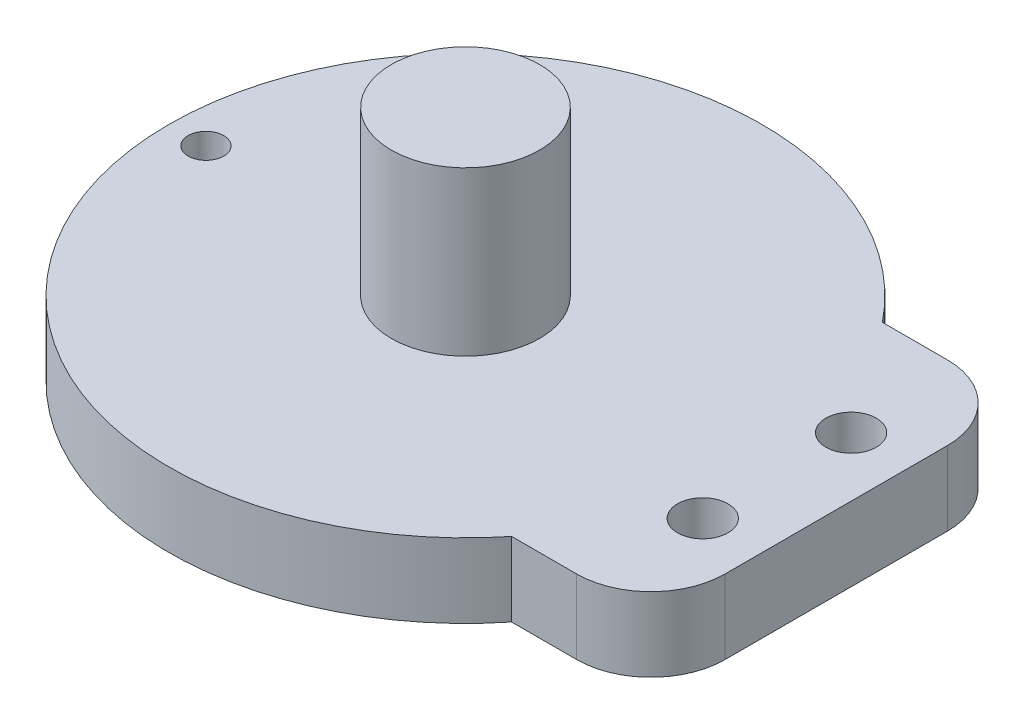
ISO-10303-21;
HEADER;
FILE_DESCRIPTION(('STEP AP214'),'2;1');
FILE_NAME('part.step','',(''),(''),'','','');
FILE_SCHEMA(('AUTOMOTIVE_DESIGN { 1 0 10303 214 1 1 1 1 }'));
ENDSEC;
DATA;
#1=APPLICATION_CONTEXT('core data for automotive mechanical design processes');
#2=APPLICATION_PROTOCOL_DEFINITION('international standard','automotive_design',2000,#1);
#3=PRODUCT_CONTEXT('',#1,'mechanical');
#4=PRODUCT('Part','Part','',(#3));
#5=PRODUCT_RELATED_PRODUCT_CATEGORY('part','',(#4));
#6=PRODUCT_DEFINITION_FORMATION('','',#4);
#7=PRODUCT_DEFINITION_CONTEXT('part definition',#1,'design');
#8=PRODUCT_DEFINITION('design','',#6,#7);
#9=PRODUCT_DEFINITION_SHAPE('','',#8);
#10=(LENGTH_UNIT() NAMED_UNIT(*) SI_UNIT(.MILLI.,.METRE.));
#11=(NAMED_UNIT(*) PLANE_ANGLE_UNIT() SI_UNIT($,.RADIAN.));
#12=(NAMED_UNIT(*) SI_UNIT($,.STERADIAN.) SOLID_ANGLE_UNIT());
#13=UNCERTAINTY_MEASURE_WITH_UNIT(LENGTH_MEASURE(1.E-05),#10,'distance_accuracy_value','');
#14=(GEOMETRIC_REPRESENTATION_CONTEXT(3) GLOBAL_UNCERTAINTY_ASSIGNED_CONTEXT((#13)) GLOBAL_UNIT_ASSIGNED_CONTEXT((#10,
#11,#12)) REPRESENTATION_CONTEXT('',''));
#15=CARTESIAN_POINT('',(0.,0.,0.));
#16=DIRECTION('',(0.,0.,1.));
#17=DIRECTION('',(1.,0.,0.));
#18=AXIS2_PLACEMENT_3D('',#15,#16,#17);
#19=CARTESIAN_POINT('',(21.,-0.00100000000000013,5.));
#20=DIRECTION('',(0.,1.,0.));
#21=DIRECTION('',(0.,0.,1.));
#22=AXIS2_PLACEMENT_3D('',#19,#20,#21);
#23=CYLINDRICAL_SURFACE('',#22,1.7);
#24=CARTESIAN_POINT('',(21.,5.,5.));
#25=DIRECTION('',(0.,1.,0.));
#26=DIRECTION('',(0.,0.,1.));
#27=AXIS2_PLACEMENT_3D('',#24,#25,#26);
#28=CIRCLE('',#27,1.7);
#29=CARTESIAN_POINT('',(21.,5.,6.7));
#30=VERTEX_POINT('',#29);
#31=EDGE_CURVE('E134',#30,#30,#28,.T.);
#32=ORIENTED_EDGE('',*,*,#31,.T.);
#33=EDGE_LOOP('',(#32));
#34=FACE_BOUND('',#33,.T.);
#35=CARTESIAN_POINT('',(21.,2.,5.));
#36=DIRECTION('',(0.,-1.,0.));
#37=DIRECTION('',(0.,0.,-1.));
#38=AXIS2_PLACEMENT_3D('',#35,#36,#37);
#39=CIRCLE('',#38,1.7);
#40=CARTESIAN_POINT('',(21.,2.,3.3));
#41=VERTEX_POINT('',#40);
#42=EDGE_CURVE('E131',#41,#41,#39,.F.);
#43=ORIENTED_EDGE('',*,*,#42,.F.);
#44=EDGE_LOOP('',(#43));
#45=FACE_BOUND('',#44,.T.);
#46=ADVANCED_FACE('F34',(#34,#45),#23,.F.);
#47=CARTESIAN_POINT('',(21.,-0.00100000000000013,-5.));
#48=DIRECTION('',(0.,1.,0.));
#49=DIRECTION('',(0.,0.,1.));
#50=AXIS2_PLACEMENT_3D('',#47,#48,#49);
#51=CYLINDRICAL_SURFACE('',#50,1.7);
#52=CARTESIAN_POINT('',(21.,5.,-5.));
#53=DIRECTION('',(0.,1.,0.));
#54=DIRECTION('',(0.,0.,1.));
#55=AXIS2_PLACEMENT_3D('',#52,#53,#54);
#56=CIRCLE('',#55,1.7);
#57=CARTESIAN_POINT('',(21.,5.,-3.3));
#58=VERTEX_POINT('',#57);
#59=EDGE_CURVE('E217',#58,#58,#56,.T.);
#60=ORIENTED_EDGE('',*,*,#59,.T.);
#61=EDGE_LOOP('',(#60));
#62=FACE_BOUND('',#61,.T.);
#63=CARTESIAN_POINT('',(21.,2.,-5.));
#64=DIRECTION('',(0.,-1.,0.));
#65=DIRECTION('',(0.,0.,-1.));
#66=AXIS2_PLACEMENT_3D('',#63,#64,#65);
#67=CIRCLE('',#66,1.7);
#68=CARTESIAN_POINT('',(21.,2.,-6.7));
#69=VERTEX_POINT('',#68);
#70=EDGE_CURVE('E127',#69,#69,#67,.F.);
#71=ORIENTED_EDGE('',*,*,#70,.F.);
#72=EDGE_LOOP('',(#71));
#73=FACE_BOUND('',#72,.T.);
#74=ADVANCED_FACE('F169',(#62,#73),#51,.F.);
#75=CARTESIAN_POINT('',(-17.5,-0.00100000000000013,0.));
#76=DIRECTION('',(0.,1.,0.));
#77=DIRECTION('',(0.,0.,1.));
#78=AXIS2_PLACEMENT_3D('',#75,#76,#77);
#79=CYLINDRICAL_SURFACE('',#78,1.2);
#80=CARTESIAN_POINT('',(-17.5,5.,0.));
#81=DIRECTION('',(0.,1.,0.));
#82=DIRECTION('',(0.,0.,1.));
#83=AXIS2_PLACEMENT_3D('',#80,#81,#82);
#84=CIRCLE('',#83,1.2);
#85=CARTESIAN_POINT('',(-17.5,5.,1.2));
#86=VERTEX_POINT('',#85);
#87=EDGE_CURVE('E213',#86,#86,#84,.T.);
#88=ORIENTED_EDGE('',*,*,#87,.T.);
#89=EDGE_LOOP('',(#88));
#90=FACE_BOUND('',#89,.T.);
#91=CARTESIAN_POINT('',(-17.5,2.,0.));
#92=DIRECTION('',(0.,-1.,0.));
#93=DIRECTION('',(0.,0.,-1.));
#94=AXIS2_PLACEMENT_3D('',#91,#92,#93);
#95=CIRCLE('',#94,1.2);
#96=CARTESIAN_POINT('',(-17.5,2.,-1.2));
#97=VERTEX_POINT('',#96);
#98=EDGE_CURVE('E124',#97,#97,#95,.F.);
#99=ORIENTED_EDGE('',*,*,#98,.F.);
#100=EDGE_LOOP('',(#99));
#101=FACE_BOUND('',#100,.T.);
#102=ADVANCED_FACE('F175',(#90,#101),#79,.F.);
#103=CARTESIAN_POINT('',(25.,5.,-12.5));
#104=DIRECTION('',(-1.,0.,0.));
#105=DIRECTION('',(0.,0.,1.));
#106=AXIS2_PLACEMENT_3D('',#103,#104,#105);
#107=PLANE('',#106);
#108=DIRECTION('',(0.,0.,-1.));
#109=VECTOR('',#108,1.);
#110=CARTESIAN_POINT('',(25.,5.,-12.5));
#111=LINE('',#110,#109);
#112=CARTESIAN_POINT('',(25.,5.,7.5));
#113=VERTEX_POINT('',#112);
#114=CARTESIAN_POINT('',(25.,5.,-7.5));
#115=VERTEX_POINT('',#114);
#116=EDGE_CURVE('E95',#113,#115,#111,.T.);
#117=ORIENTED_EDGE('',*,*,#116,.F.);
#118=DIRECTION('',(0.,-1.,0.));
#119=VECTOR('',#118,1.);
#120=CARTESIAN_POINT('',(25.,5.,7.5));
#121=LINE('',#120,#119);
#122=CARTESIAN_POINT('',(25.,0.,7.5));
#123=VERTEX_POINT('',#122);
#124=EDGE_CURVE('E136',#113,#123,#121,.T.);
#125=ORIENTED_EDGE('',*,*,#124,.T.);
#126=DIRECTION('',(0.,0.,-1.));
#127=VECTOR('',#126,1.);
#128=CARTESIAN_POINT('',(25.,0.,-12.5));
#129=LINE('',#128,#127);
#130=CARTESIAN_POINT('',(25.,0.,-7.5));
#131=VERTEX_POINT('',#130);
#132=EDGE_CURVE('E114',#123,#131,#129,.T.);
#133=ORIENTED_EDGE('',*,*,#132,.T.);
#134=DIRECTION('',(0.,-1.,0.));
#135=VECTOR('',#134,1.);
#136=CARTESIAN_POINT('',(25.,5.,-7.5));
#137=LINE('',#136,#135);
#138=EDGE_CURVE('E104',#131,#115,#137,.F.);
#139=ORIENTED_EDGE('',*,*,#138,.T.);
#140=EDGE_LOOP('',(#117,#125,#133,#139));
#141=FACE_BOUND('',#140,.T.);
#142=ADVANCED_FACE('F149',(#141),#107,.F.);
#143=CARTESIAN_POINT('',(15.612494995996,5.,-12.5));
#144=DIRECTION('',(0.,0.,1.));
#145=DIRECTION('',(1.,0.,0.));
#146=AXIS2_PLACEMENT_3D('',#143,#144,#145);
#147=PLANE('',#146);
#148=DIRECTION('',(-1.,0.,0.));
#149=VECTOR('',#148,1.);
#150=CARTESIAN_POINT('',(15.612494995996,5.,-12.5));
#151=LINE('',#150,#149);
#152=CARTESIAN_POINT('',(20.,5.,-12.5));
#153=VERTEX_POINT('',#152);
#154=CARTESIAN_POINT('',(15.612494995996,5.,-12.5));
#155=VERTEX_POINT('',#154);
#156=EDGE_CURVE('E87',#153,#155,#151,.T.);
#157=ORIENTED_EDGE('',*,*,#156,.F.);
#158=DIRECTION('',(0.,-1.,0.));
#159=VECTOR('',#158,1.);
#160=CARTESIAN_POINT('',(20.,5.,-12.5));
#161=LINE('',#160,#159);
#162=CARTESIAN_POINT('',(20.,0.,-12.5));
#163=VERTEX_POINT('',#162);
#164=EDGE_CURVE('E11',#153,#163,#161,.T.);
#165=ORIENTED_EDGE('',*,*,#164,.T.);
#166=DIRECTION('',(-1.,0.,0.));
#167=VECTOR('',#166,1.);
#168=CARTESIAN_POINT('',(15.612494995996,0.,-12.5));
#169=LINE('',#168,#167);
#170=CARTESIAN_POINT('',(15.612494995996,0.,-12.5));
#171=VERTEX_POINT('',#170);
#172=EDGE_CURVE('E101',#163,#171,#169,.T.);
#173=ORIENTED_EDGE('',*,*,#172,.T.);
#174=DIRECTION('',(0.,-1.,0.));
#175=VECTOR('',#174,1.);
#176=CARTESIAN_POINT('',(15.612494995996,5.,-12.5));
#177=LINE('',#176,#175);
#178=EDGE_CURVE('E98',#155,#171,#177,.T.);
#179=ORIENTED_EDGE('',*,*,#178,.F.);
#180=EDGE_LOOP('',(#157,#165,#173,#179));
#181=FACE_BOUND('',#180,.T.);
#182=ADVANCED_FACE('F99',(#181),#147,.F.);
#183=CARTESIAN_POINT('',(0.,5.,0.));
#184=DIRECTION('',(0.,-1.,0.));
#185=DIRECTION('',(0.,0.,-1.));
#186=AXIS2_PLACEMENT_3D('',#183,#184,#185);
#187=CYLINDRICAL_SURFACE('',#186,20.);
#188=CARTESIAN_POINT('',(0.,0.,0.));
#189=DIRECTION('',(0.,1.,0.));
#190=DIRECTION('',(0.,0.,1.));
#191=AXIS2_PLACEMENT_3D('',#188,#189,#190);
#192=CIRCLE('',#191,20.);
#193=CARTESIAN_POINT('',(15.612494995996,0.,12.5));
#194=VERTEX_POINT('',#193);
#195=EDGE_CURVE('E119',#171,#194,#192,.T.);
#196=ORIENTED_EDGE('',*,*,#195,.T.);
#197=DIRECTION('',(0.,-1.,0.));
#198=VECTOR('',#197,1.);
#199=CARTESIAN_POINT('',(15.612494995996,5.,12.5));
#200=LINE('',#199,#198);
#201=CARTESIAN_POINT('',(15.612494995996,5.,12.5));
#202=VERTEX_POINT('',#201);
#203=EDGE_CURVE('E105',#202,#194,#200,.T.);
#204=ORIENTED_EDGE('',*,*,#203,.F.);
#205=CARTESIAN_POINT('',(0.,5.,0.));
#206=DIRECTION('',(0.,1.,0.));
#207=DIRECTION('',(0.,0.,1.));
#208=AXIS2_PLACEMENT_3D('',#205,#206,#207);
#209=CIRCLE('',#208,20.);
#210=EDGE_CURVE('E91',#155,#202,#209,.T.);
#211=ORIENTED_EDGE('',*,*,#210,.F.);
#212=ORIENTED_EDGE('',*,*,#178,.T.);
#213=EDGE_LOOP('',(#196,#204,#211,#212));
#214=FACE_BOUND('',#213,.T.);
#215=ADVANCED_FACE('F107',(#214),#187,.T.);
#216=CARTESIAN_POINT('',(15.612494995996,5.,12.5));
#217=DIRECTION('',(0.,0.,-1.));
#218=DIRECTION('',(-1.,0.,0.));
#219=AXIS2_PLACEMENT_3D('',#216,#217,#218);
#220=PLANE('',#219);
#221=DIRECTION('',(1.,0.,0.));
#222=VECTOR('',#221,1.);
#223=CARTESIAN_POINT('',(15.612494995996,0.,12.5));
#224=LINE('',#223,#222);
#225=CARTESIAN_POINT('',(20.,0.,12.5));
#226=VERTEX_POINT('',#225);
#227=EDGE_CURVE('E121',#194,#226,#224,.T.);
#228=ORIENTED_EDGE('',*,*,#227,.T.);
#229=DIRECTION('',(0.,-1.,0.));
#230=VECTOR('',#229,1.);
#231=CARTESIAN_POINT('',(20.,5.,12.5));
#232=LINE('',#231,#230);
#233=CARTESIAN_POINT('',(20.,5.,12.5));
#234=VERTEX_POINT('',#233);
#235=EDGE_CURVE('E57',#226,#234,#232,.F.);
#236=ORIENTED_EDGE('',*,*,#235,.T.);
#237=DIRECTION('',(1.,0.,0.));
#238=VECTOR('',#237,1.);
#239=CARTESIAN_POINT('',(15.612494995996,5.,12.5));
#240=LINE('',#239,#238);
#241=EDGE_CURVE('E109',#202,#234,#240,.T.);
#242=ORIENTED_EDGE('',*,*,#241,.F.);
#243=ORIENTED_EDGE('',*,*,#203,.T.);
#244=EDGE_LOOP('',(#228,#236,#242,#243));
#245=FACE_BOUND('',#244,.T.);
#246=ADVANCED_FACE('F156',(#245),#220,.F.);
#247=CARTESIAN_POINT('',(0.,5.,0.));
#248=DIRECTION('',(0.,1.,0.));
#249=DIRECTION('',(0.,0.,1.));
#250=AXIS2_PLACEMENT_3D('',#247,#248,#249);
#251=PLANE('',#250);
#252=ORIENTED_EDGE('',*,*,#87,.F.);
#253=EDGE_LOOP('',(#252));
#254=FACE_BOUND('',#253,.T.);
#255=ORIENTED_EDGE('',*,*,#59,.F.);
#256=EDGE_LOOP('',(#255));
#257=FACE_BOUND('',#256,.T.);
#258=ORIENTED_EDGE('',*,*,#31,.F.);
#259=EDGE_LOOP('',(#258));
#260=FACE_BOUND('',#259,.T.);
#261=CARTESIAN_POINT('',(0.,5.,0.));
#262=DIRECTION('',(0.,1.,0.));
#263=DIRECTION('',(0.,0.,1.));
#264=AXIS2_PLACEMENT_3D('',#261,#262,#263);
#265=CIRCLE('',#264,5.);
#266=CARTESIAN_POINT('',(0.,5.,5.));
#267=VERTEX_POINT('',#266);
#268=EDGE_CURVE('E216',#267,#267,#265,.T.);
#269=ORIENTED_EDGE('',*,*,#268,.F.);
#270=EDGE_LOOP('',(#269));
#271=FACE_BOUND('',#270,.T.);
#272=ORIENTED_EDGE('',*,*,#241,.T.);
#273=CARTESIAN_POINT('',(20.,5.,7.5));
#274=DIRECTION('',(0.,1.,0.));
#275=DIRECTION('',(0.,0.,1.));
#276=AXIS2_PLACEMENT_3D('',#273,#274,#275);
#277=CIRCLE('',#276,5.);
#278=EDGE_CURVE('E42',#234,#113,#277,.T.);
#279=ORIENTED_EDGE('',*,*,#278,.T.);
#280=ORIENTED_EDGE('',*,*,#116,.T.);
#281=CARTESIAN_POINT('',(20.,5.,-7.5));
#282=DIRECTION('',(0.,1.,0.));
#283=DIRECTION('',(0.,0.,1.));
#284=AXIS2_PLACEMENT_3D('',#281,#282,#283);
#285=CIRCLE('',#284,5.);
#286=EDGE_CURVE('E49',#115,#153,#285,.T.);
#287=ORIENTED_EDGE('',*,*,#286,.T.);
#288=ORIENTED_EDGE('',*,*,#156,.T.);
#289=ORIENTED_EDGE('',*,*,#210,.T.);
#290=EDGE_LOOP('',(#272,#279,#280,#287,#288,#289));
#291=FACE_BOUND('',#290,.T.);
#292=ADVANCED_FACE('F89',(#254,#257,#260,#271,#291),#251,.T.);
#293=CARTESIAN_POINT('',(0.,0.,0.));
#294=DIRECTION('',(0.,1.,0.));
#295=DIRECTION('',(0.,0.,1.));
#296=AXIS2_PLACEMENT_3D('',#293,#294,#295);
#297=PLANE('',#296);
#298=CARTESIAN_POINT('',(-17.5,0.,0.));
#299=DIRECTION('',(0.,-1.,0.));
#300=DIRECTION('',(0.,0.,-1.));
#301=AXIS2_PLACEMENT_3D('',#298,#299,#300);
#302=CIRCLE('',#301,2.);
#303=CARTESIAN_POINT('',(-17.5,0.,-2.));
#304=VERTEX_POINT('',#303);
#305=EDGE_CURVE('E198',#304,#304,#302,.T.);
#306=ORIENTED_EDGE('',*,*,#305,.F.);
#307=EDGE_LOOP('',(#306));
#308=FACE_BOUND('',#307,.T.);
#309=CARTESIAN_POINT('',(21.,0.,5.));
#310=DIRECTION('',(0.,-1.,0.));
#311=DIRECTION('',(0.,0.,-1.));
#312=AXIS2_PLACEMENT_3D('',#309,#310,#311);
#313=CIRCLE('',#312,3.);
#314=CARTESIAN_POINT('',(21.,0.,2.));
#315=VERTEX_POINT('',#314);
#316=EDGE_CURVE('E202',#315,#315,#313,.T.);
#317=ORIENTED_EDGE('',*,*,#316,.F.);
#318=EDGE_LOOP('',(#317));
#319=FACE_BOUND('',#318,.T.);
#320=CARTESIAN_POINT('',(21.,0.,-5.));
#321=DIRECTION('',(0.,-1.,0.));
#322=DIRECTION('',(0.,0.,-1.));
#323=AXIS2_PLACEMENT_3D('',#320,#321,#322);
#324=CIRCLE('',#323,3.);
#325=CARTESIAN_POINT('',(21.,0.,-8.));
#326=VERTEX_POINT('',#325);
#327=EDGE_CURVE('E205',#326,#326,#324,.T.);
#328=ORIENTED_EDGE('',*,*,#327,.F.);
#329=EDGE_LOOP('',(#328));
#330=FACE_BOUND('',#329,.T.);
#331=ORIENTED_EDGE('',*,*,#132,.F.);
#332=CARTESIAN_POINT('',(20.,0.,7.5));
#333=DIRECTION('',(0.,1.,0.));
#334=DIRECTION('',(0.,0.,1.));
#335=AXIS2_PLACEMENT_3D('',#332,#333,#334);
#336=CIRCLE('',#335,5.);
#337=EDGE_CURVE('E141',#123,#226,#336,.F.);
#338=ORIENTED_EDGE('',*,*,#337,.T.);
#339=ORIENTED_EDGE('',*,*,#227,.F.);
#340=ORIENTED_EDGE('',*,*,#195,.F.);
#341=ORIENTED_EDGE('',*,*,#172,.F.);
#342=CARTESIAN_POINT('',(20.,0.,-7.5));
#343=DIRECTION('',(0.,1.,0.));
#344=DIRECTION('',(0.,0.,1.));
#345=AXIS2_PLACEMENT_3D('',#342,#343,#344);
#346=CIRCLE('',#345,5.);
#347=EDGE_CURVE('E139',#163,#131,#346,.F.);
#348=ORIENTED_EDGE('',*,*,#347,.T.);
#349=EDGE_LOOP('',(#331,#338,#339,#340,#341,#348));
#350=FACE_BOUND('',#349,.T.);
#351=ADVANCED_FACE('F155',(#308,#319,#330,#350),#297,.F.);
#352=CARTESIAN_POINT('',(0.,16.,0.));
#353=DIRECTION('',(0.,-1.,0.));
#354=DIRECTION('',(0.,0.,-1.));
#355=AXIS2_PLACEMENT_3D('',#352,#353,#354);
#356=CYLINDRICAL_SURFACE('',#355,5.);
#357=CARTESIAN_POINT('',(0.,16.,0.));
#358=DIRECTION('',(0.,1.,0.));
#359=DIRECTION('',(0.,0.,1.));
#360=AXIS2_PLACEMENT_3D('',#357,#358,#359);
#361=CIRCLE('',#360,5.);
#362=CARTESIAN_POINT('',(0.,16.,5.));
#363=VERTEX_POINT('',#362);
#364=EDGE_CURVE('E117',#363,#363,#361,.T.);
#365=ORIENTED_EDGE('',*,*,#364,.F.);
#366=EDGE_LOOP('',(#365));
#367=FACE_BOUND('',#366,.T.);
#368=ORIENTED_EDGE('',*,*,#268,.T.);
#369=EDGE_LOOP('',(#368));
#370=FACE_BOUND('',#369,.T.);
#371=ADVANCED_FACE('F186',(#367,#370),#356,.T.);
#372=CARTESIAN_POINT('',(0.,16.,0.));
#373=DIRECTION('',(0.,1.,0.));
#374=DIRECTION('',(0.,0.,1.));
#375=AXIS2_PLACEMENT_3D('',#372,#373,#374);
#376=PLANE('',#375);
#377=ORIENTED_EDGE('',*,*,#364,.T.);
#378=EDGE_LOOP('',(#377));
#379=FACE_BOUND('',#378,.T.);
#380=ADVANCED_FACE('F182',(#379),#376,.T.);
#381=CARTESIAN_POINT('',(-17.5,2.,0.));
#382=DIRECTION('',(0.,-1.,0.));
#383=DIRECTION('',(0.,0.,-1.));
#384=AXIS2_PLACEMENT_3D('',#381,#382,#383);
#385=PLANE('',#384);
#386=CARTESIAN_POINT('',(-17.5,2.,0.));
#387=DIRECTION('',(0.,-1.,0.));
#388=DIRECTION('',(0.,0.,-1.));
#389=AXIS2_PLACEMENT_3D('',#386,#387,#388);
#390=CIRCLE('',#389,2.);
#391=CARTESIAN_POINT('',(-17.5,2.,-2.));
#392=VERTEX_POINT('',#391);
#393=EDGE_CURVE('E128',#392,#392,#390,.T.);
#394=ORIENTED_EDGE('',*,*,#393,.T.);
#395=EDGE_LOOP('',(#394));
#396=FACE_BOUND('',#395,.T.);
#397=ORIENTED_EDGE('',*,*,#98,.T.);
#398=EDGE_LOOP('',(#397));
#399=FACE_BOUND('',#398,.T.);
#400=ADVANCED_FACE('F185',(#396,#399),#385,.T.);
#401=CARTESIAN_POINT('',(-17.5,2.,0.));
#402=DIRECTION('',(0.,-1.,0.));
#403=DIRECTION('',(0.,0.,-1.));
#404=AXIS2_PLACEMENT_3D('',#401,#402,#403);
#405=CYLINDRICAL_SURFACE('',#404,2.);
#406=ORIENTED_EDGE('',*,*,#393,.F.);
#407=EDGE_LOOP('',(#406));
#408=FACE_BOUND('',#407,.T.);
#409=ORIENTED_EDGE('',*,*,#305,.T.);
#410=EDGE_LOOP('',(#409));
#411=FACE_BOUND('',#410,.T.);
#412=ADVANCED_FACE('F238',(#408,#411),#405,.F.);
#413=CARTESIAN_POINT('',(21.,2.,-5.));
#414=DIRECTION('',(0.,-1.,0.));
#415=DIRECTION('',(0.,0.,-1.));
#416=AXIS2_PLACEMENT_3D('',#413,#414,#415);
#417=PLANE('',#416);
#418=CARTESIAN_POINT('',(21.,2.,-5.));
#419=DIRECTION('',(0.,-1.,0.));
#420=DIRECTION('',(0.,0.,-1.));
#421=AXIS2_PLACEMENT_3D('',#418,#419,#420);
#422=CIRCLE('',#421,3.);
#423=CARTESIAN_POINT('',(21.,2.,-8.));
#424=VERTEX_POINT('',#423);
#425=EDGE_CURVE('E207',#424,#424,#422,.T.);
#426=ORIENTED_EDGE('',*,*,#425,.T.);
#427=EDGE_LOOP('',(#426));
#428=FACE_BOUND('',#427,.T.);
#429=ORIENTED_EDGE('',*,*,#70,.T.);
#430=EDGE_LOOP('',(#429));
#431=FACE_BOUND('',#430,.T.);
#432=ADVANCED_FACE('F235',(#428,#431),#417,.T.);
#433=CARTESIAN_POINT('',(21.,2.,-5.));
#434=DIRECTION('',(0.,-1.,0.));
#435=DIRECTION('',(0.,0.,-1.));
#436=AXIS2_PLACEMENT_3D('',#433,#434,#435);
#437=CYLINDRICAL_SURFACE('',#436,3.);
#438=ORIENTED_EDGE('',*,*,#425,.F.);
#439=EDGE_LOOP('',(#438));
#440=FACE_BOUND('',#439,.T.);
#441=ORIENTED_EDGE('',*,*,#327,.T.);
#442=EDGE_LOOP('',(#441));
#443=FACE_BOUND('',#442,.T.);
#444=ADVANCED_FACE('F237',(#440,#443),#437,.F.);
#445=CARTESIAN_POINT('',(21.,2.,5.));
#446=DIRECTION('',(0.,-1.,0.));
#447=DIRECTION('',(0.,0.,-1.));
#448=AXIS2_PLACEMENT_3D('',#445,#446,#447);
#449=PLANE('',#448);
#450=CARTESIAN_POINT('',(21.,2.,5.));
#451=DIRECTION('',(0.,-1.,0.));
#452=DIRECTION('',(0.,0.,-1.));
#453=AXIS2_PLACEMENT_3D('',#450,#451,#452);
#454=CIRCLE('',#453,3.);
#455=CARTESIAN_POINT('',(21.,2.,2.));
#456=VERTEX_POINT('',#455);
#457=EDGE_CURVE('E279',#456,#456,#454,.T.);
#458=ORIENTED_EDGE('',*,*,#457,.T.);
#459=EDGE_LOOP('',(#458));
#460=FACE_BOUND('',#459,.T.);
#461=ORIENTED_EDGE('',*,*,#42,.T.);
#462=EDGE_LOOP('',(#461));
#463=FACE_BOUND('',#462,.T.);
#464=ADVANCED_FACE('F245',(#460,#463),#449,.T.);
#465=CARTESIAN_POINT('',(21.,2.,5.));
#466=DIRECTION('',(0.,-1.,0.));
#467=DIRECTION('',(0.,0.,-1.));
#468=AXIS2_PLACEMENT_3D('',#465,#466,#467);
#469=CYLINDRICAL_SURFACE('',#468,3.);
#470=ORIENTED_EDGE('',*,*,#457,.F.);
#471=EDGE_LOOP('',(#470));
#472=FACE_BOUND('',#471,.T.);
#473=ORIENTED_EDGE('',*,*,#316,.T.);
#474=EDGE_LOOP('',(#473));
#475=FACE_BOUND('',#474,.T.);
#476=ADVANCED_FACE('F251',(#472,#475),#469,.F.);
#477=CARTESIAN_POINT('',(20.,5.,7.5));
#478=DIRECTION('',(0.,-1.,0.));
#479=DIRECTION('',(0.,0.,-1.));
#480=AXIS2_PLACEMENT_3D('',#477,#478,#479);
#481=CYLINDRICAL_SURFACE('',#480,5.);
#482=ORIENTED_EDGE('',*,*,#278,.F.);
#483=ORIENTED_EDGE('',*,*,#235,.F.);
#484=ORIENTED_EDGE('',*,*,#337,.F.);
#485=ORIENTED_EDGE('',*,*,#124,.F.);
#486=EDGE_LOOP('',(#482,#483,#484,#485));
#487=FACE_BOUND('',#486,.T.);
#488=ADVANCED_FACE('F152',(#487),#481,.T.);
#489=CARTESIAN_POINT('',(20.,5.,-7.5));
#490=DIRECTION('',(0.,-1.,0.));
#491=DIRECTION('',(0.,0.,-1.));
#492=AXIS2_PLACEMENT_3D('',#489,#490,#491);
#493=CYLINDRICAL_SURFACE('',#492,5.);
#494=ORIENTED_EDGE('',*,*,#286,.F.);
#495=ORIENTED_EDGE('',*,*,#138,.F.);
#496=ORIENTED_EDGE('',*,*,#347,.F.);
#497=ORIENTED_EDGE('',*,*,#164,.F.);
#498=EDGE_LOOP('',(#494,#495,#496,#497));
#499=FACE_BOUND('',#498,.T.);
#500=ADVANCED_FACE('F36',(#499),#493,.T.);
#501=CLOSED_SHELL('',(#46,#74,#102,#142,#182,#215,#246,#292,#351,#371,#380,#400,#412,#432,#444,
#464,#476,#488,#500));
#502=MANIFOLD_SOLID_BREP('B2',#501);
#503=ADVANCED_BREP_SHAPE_REPRESENTATION('',(#18,#502),#14);
#504=SHAPE_DEFINITION_REPRESENTATION(#9,#503);
ENDSEC;
END-ISO-10303-21;
